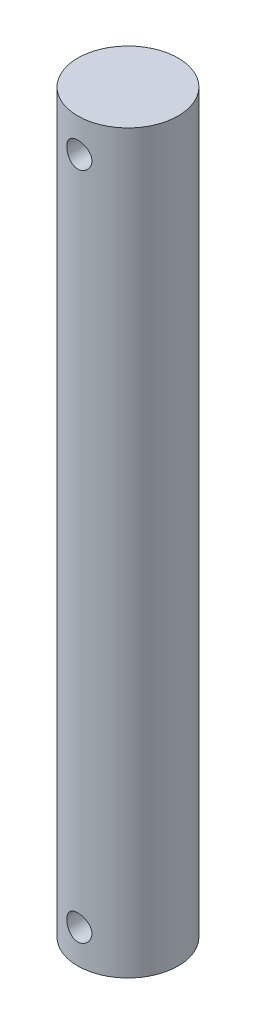
ISO-10303-21;
HEADER;
FILE_DESCRIPTION(('STEP AP214'),'2;1');
FILE_NAME('part.step','',(''),(''),'','','');
FILE_SCHEMA(('AUTOMOTIVE_DESIGN { 1 0 10303 214 1 1 1 1 }'));
ENDSEC;
DATA;
#1=APPLICATION_CONTEXT('core data for automotive mechanical design processes');
#2=APPLICATION_PROTOCOL_DEFINITION('international standard','automotive_design',2000,#1);
#3=PRODUCT_CONTEXT('',#1,'mechanical');
#4=PRODUCT('Part','Part','',(#3));
#5=PRODUCT_RELATED_PRODUCT_CATEGORY('part','',(#4));
#6=PRODUCT_DEFINITION_FORMATION('','',#4);
#7=PRODUCT_DEFINITION_CONTEXT('part definition',#1,'design');
#8=PRODUCT_DEFINITION('design','',#6,#7);
#9=PRODUCT_DEFINITION_SHAPE('','',#8);
#10=(LENGTH_UNIT() NAMED_UNIT(*) SI_UNIT(.MILLI.,.METRE.));
#11=(NAMED_UNIT(*) PLANE_ANGLE_UNIT() SI_UNIT($,.RADIAN.));
#12=(NAMED_UNIT(*) SI_UNIT($,.STERADIAN.) SOLID_ANGLE_UNIT());
#13=UNCERTAINTY_MEASURE_WITH_UNIT(LENGTH_MEASURE(1.E-05),#10,'distance_accuracy_value','');
#14=(GEOMETRIC_REPRESENTATION_CONTEXT(3) GLOBAL_UNCERTAINTY_ASSIGNED_CONTEXT((#13)) GLOBAL_UNIT_ASSIGNED_CONTEXT((#10,
#11,#12)) REPRESENTATION_CONTEXT('',''));
#15=CARTESIAN_POINT('',(0.,0.,0.));
#16=DIRECTION('',(0.,0.,1.));
#17=DIRECTION('',(1.,0.,0.));
#18=AXIS2_PLACEMENT_3D('',#15,#16,#17);
#19=CARTESIAN_POINT('',(0.,279.4,0.));
#20=DIRECTION('',(0.,-1.,0.));
#21=DIRECTION('',(0.,0.,-1.));
#22=AXIS2_PLACEMENT_3D('',#19,#20,#21);
#23=CYLINDRICAL_SURFACE('',#22,19.05);
#24=CARTESIAN_POINT('',(0.,17.4625,-19.05));
#25=CARTESIAN_POINT('',(-0.263131581526396,17.4624926157813,-19.0499955508094));
#26=CARTESIAN_POINT('',(-0.526345651112673,17.4406193262932,-19.0444938556855));
#27=CARTESIAN_POINT('',(-1.04523007797144,17.3538351446003,-19.0230796140991));
#28=CARTESIAN_POINT('',(-1.30089607381459,17.2888998597173,-19.0071611670842));
#29=CARTESIAN_POINT('',(-1.79711626917968,17.1182053702579,-18.966676136042));
#30=CARTESIAN_POINT('',(-2.03768821389026,17.012495189079,-18.9421199402354));
#31=CARTESIAN_POINT('',(-2.49768401879656,16.7634240866076,-18.886974665892));
#32=CARTESIAN_POINT('',(-2.71710716530732,16.6200618953223,-18.8563853838695));
#33=CARTESIAN_POINT('',(-3.13309611918041,16.296637492848,-18.7917903815363));
#34=CARTESIAN_POINT('',(-3.32916431594386,16.115945749505,-18.757731951953));
#35=CARTESIAN_POINT('',(-3.68855284387054,15.7243392494138,-18.6903874387445));
#36=CARTESIAN_POINT('',(-3.85186947731367,15.5134210846434,-18.6571014427033));
#37=CARTESIAN_POINT('',(-4.14345927338673,15.06348515511,-18.5945391284169));
#38=CARTESIAN_POINT('',(-4.27117578556232,14.8240964921822,-18.5653297242578));
#39=CARTESIAN_POINT('',(-4.48436018464861,14.3263987929793,-18.514996460472));
#40=CARTESIAN_POINT('',(-4.56983482602243,14.0680927891708,-18.4938713082978));
#41=CARTESIAN_POINT('',(-4.6944116068551,13.5453643932097,-18.4626401351082));
#42=CARTESIAN_POINT('',(-4.73440845195425,13.2811682050793,-18.4523218391551));
#43=CARTESIAN_POINT('',(-4.76968113583582,12.749629793427,-18.443237258092));
#44=CARTESIAN_POINT('',(-4.76496425027247,12.4822880888024,-18.4444690935868));
#45=CARTESIAN_POINT('',(-4.71165721573103,11.9589048104085,-18.458154775159));
#46=CARTESIAN_POINT('',(-4.66413323010523,11.7027464018475,-18.4703359004816));
#47=CARTESIAN_POINT('',(-4.52826179341697,11.2021586633574,-18.5041130320564));
#48=CARTESIAN_POINT('',(-4.43991143407028,10.9577301703831,-18.5257097090233));
#49=CARTESIAN_POINT('',(-4.22398659245052,10.4846817983995,-18.5761348665047));
#50=CARTESIAN_POINT('',(-4.09602516846447,10.2562464045681,-18.6050341471667));
#51=CARTESIAN_POINT('',(-3.80478117634741,9.82370809652206,-18.6667683193602));
#52=CARTESIAN_POINT('',(-3.64149242746802,9.61960944988645,-18.6996038991245));
#53=CARTESIAN_POINT('',(-3.27870637336283,9.23542852017023,-18.7666592071416));
#54=CARTESIAN_POINT('',(-3.07830936967656,9.05619699405519,-18.8008917059265));
#55=CARTESIAN_POINT('',(-2.64989283807419,8.73372255517709,-18.8660394071255));
#56=CARTESIAN_POINT('',(-2.42187246672267,8.59048074171316,-18.8969545081937));
#57=CARTESIAN_POINT('',(-1.94346794656337,8.34373938873755,-18.9521379939906));
#58=CARTESIAN_POINT('',(-1.69300967343733,8.24037804469218,-18.9763831840553));
#59=CARTESIAN_POINT('',(-1.1775313258536,8.0774625543721,-19.0153263644775));
#60=CARTESIAN_POINT('',(-0.912514047302736,8.0179000283724,-19.0300261810222));
#61=CARTESIAN_POINT('',(-0.382714405988285,7.94557222935068,-19.0479521018661));
#62=CARTESIAN_POINT('',(-0.118099585962517,7.93164839221091,-19.0514621988878));
#63=CARTESIAN_POINT('',(0.409679377494838,7.94781558152618,-19.0474220528589));
#64=CARTESIAN_POINT('',(0.672843649371642,7.97790264588726,-19.0398728054288));
#65=CARTESIAN_POINT('',(1.1862253033654,8.08028263414262,-19.0147442007933));
#66=CARTESIAN_POINT('',(1.43657675272583,8.1519435115394,-18.9973151353987));
#67=CARTESIAN_POINT('',(1.92169190353678,8.33471499179037,-18.9543914356345));
#68=CARTESIAN_POINT('',(2.15645402792872,8.44582957869448,-18.928895986747));
#69=CARTESIAN_POINT('',(2.60833595181475,8.7065997091771,-18.8719875266574));
#70=CARTESIAN_POINT('',(2.82506877782859,8.85690415685911,-18.8404775388889));
#71=CARTESIAN_POINT('',(3.23064699831755,9.19095796043101,-18.7751881667117));
#72=CARTESIAN_POINT('',(3.41948756974011,9.374713088286,-18.7414083912834));
#73=CARTESIAN_POINT('',(3.76869505363016,9.77583122567883,-18.6743643834617));
#74=CARTESIAN_POINT('',(3.92824927969698,9.99390845702379,-18.6411331577848));
#75=CARTESIAN_POINT('',(4.20849665986835,10.4544261144376,-18.5798738886387));
#76=CARTESIAN_POINT('',(4.3291915389627,10.6968654584305,-18.5518456142307));
#77=CARTESIAN_POINT('',(4.52739576042814,11.1979256686405,-18.5044745072254));
#78=CARTESIAN_POINT('',(4.60516095934267,11.456440219894,-18.4850803532866));
#79=CARTESIAN_POINT('',(4.71597247031959,11.9834331001882,-18.4571241228829));
#80=CARTESIAN_POINT('',(4.74902856223882,12.2519092369841,-18.448559677509));
#81=CARTESIAN_POINT('',(4.76897252431613,12.7829342507806,-18.4434131133217));
#82=CARTESIAN_POINT('',(4.75715932544309,13.0454318565813,-18.4464938626328));
#83=CARTESIAN_POINT('',(4.69067285863097,13.5645648465644,-18.4635111092241));
#84=CARTESIAN_POINT('',(4.63600045202908,13.8212003484504,-18.4774473883417));
#85=CARTESIAN_POINT('',(4.48605693923537,14.3199118575155,-18.5144175271476));
#86=CARTESIAN_POINT('',(4.39102945986142,14.5620654441331,-18.5373967338792));
#87=CARTESIAN_POINT('',(4.16326610069491,15.0271650901206,-18.5898712441369));
#88=CARTESIAN_POINT('',(4.03052499085823,15.2501084798697,-18.6193674513003));
#89=CARTESIAN_POINT('',(3.72703010192325,15.6767359470801,-18.6825138879017));
#90=CARTESIAN_POINT('',(3.55537504224652,15.8797659081207,-18.7162524084177));
#91=CARTESIAN_POINT('',(3.18068125352734,16.2545618672258,-18.7835548650601));
#92=CARTESIAN_POINT('',(2.97763508250412,16.4263204306088,-18.8171187578316));
#93=CARTESIAN_POINT('',(2.54148458778075,16.7367309046925,-18.8810155668159));
#94=CARTESIAN_POINT('',(2.30790249085454,16.8747268984072,-18.911278959367));
#95=CARTESIAN_POINT('',(1.82011973894576,17.1092731948362,-18.9644313679593));
#96=CARTESIAN_POINT('',(1.56593401391164,17.2058531950591,-18.9873256650929));
#97=CARTESIAN_POINT('',(1.09350255404802,17.3404905612966,-19.0197758912061));
#98=CARTESIAN_POINT('',(0.877507042633118,17.3861451966946,-19.031032075423));
#99=CARTESIAN_POINT('',(0.441026777127701,17.4471518709997,-19.0461457161143));
#100=CARTESIAN_POINT('',(0.220542361945307,17.4625061890443,-19.0500037290659));
#101=CARTESIAN_POINT('',(0.,17.4625,-19.05));
#102=B_SPLINE_CURVE_WITH_KNOTS('',3,(#24,#25,#26,#27,#28,#29,#30,#31,#32,#33,#34,#35,#36,#37,
#38,#39,#40,#41,#42,#43,#44,#45,#46,#47,#48,#49,#50,#51,#52,#53,#54,#55,#56,#57,#58,#59,#60,#61,
#62,#63,#64,#65,#66,#67,#68,#69,#70,#71,#72,#73,#74,#75,#76,#77,#78,#79,#80,#81,#82,#83,#84,#85,
#86,#87,#88,#89,#90,#91,#92,#93,#94,#95,#96,#97,#98,#99,#100,#101),.UNSPECIFIED.,.T.,.F.,(4,2,2,
2,2,2,2,2,2,2,2,2,2,2,2,2,2,2,2,2,2,2,2,2,2,2,2,2,2,2,2,2,2,2,2,2,2,2,4),(0.,0.788586537098248,
1.57762015490038,2.36570806475839,3.15382256003762,3.95650832512918,4.75928466416698,
5.57398705957939,6.38855914212746,7.18681236945898,7.98493571018357,8.76371428007826,
9.54254833515216,10.3292442601011,11.1160779341536,11.9253476558718,12.7346420935798,
13.5467162711448,14.3586350397198,15.149776309245,15.940846360435,16.7201937159261,
17.4996197925881,18.2928764053053,19.08627002561,19.8991381673475,20.7119702204023,
21.51990408414,22.3276611884506,23.1122150278763,23.8967531006066,24.6766207180149,
25.4565965385991,26.2569190512671,27.0574315904632,27.8724418898644,28.6868668015803,
29.3478662136657,30.008815904619),.UNSPECIFIED.);
#103=CARTESIAN_POINT('',(0.,17.4625,-19.05));
#104=VERTEX_POINT('',#103);
#105=EDGE_CURVE('E10',#104,#104,#102,.T.);
#106=ORIENTED_EDGE('',*,*,#105,.T.);
#107=EDGE_LOOP('',(#106));
#108=FACE_BOUND('',#107,.T.);
#109=CARTESIAN_POINT('',(4.7625,12.7,18.4450831863128));
#110=CARTESIAN_POINT('',(4.7624925297198,12.4370133194849,18.4450882066737));
#111=CARTESIAN_POINT('',(4.74064249767304,12.1739439680174,18.4507690295781));
#112=CARTESIAN_POINT('',(4.65395905400856,11.6553597635795,18.4728204709583));
#113=CARTESIAN_POINT('',(4.58910062634373,11.3998493977381,18.489197310742));
#114=CARTESIAN_POINT('',(4.41863073529905,10.9039592597534,18.5306727035566));
#115=CARTESIAN_POINT('',(4.31307188156282,10.6635604189902,18.5557599932532));
#116=CARTESIAN_POINT('',(4.06435777410296,10.2038578259115,18.6118155581478));
#117=CARTESIAN_POINT('',(3.92120092420813,9.98455496973717,18.6427840830102));
#118=CARTESIAN_POINT('',(3.59798955402915,9.56844356577547,18.7078756465746));
#119=CARTESIAN_POINT('',(3.41725927107623,9.37216769133315,18.7420490847188));
#120=CARTESIAN_POINT('',(3.02548683211178,9.01237454374355,18.8092627785663));
#121=CARTESIAN_POINT('',(2.81444184541351,8.84886033319056,18.8423029280897));
#122=CARTESIAN_POINT('',(2.36438160805543,8.55705273416241,18.9040849156671));
#123=CARTESIAN_POINT('',(2.12501716765172,8.42928263055241,18.9327603449813));
#124=CARTESIAN_POINT('',(1.62737136607773,8.21599262788838,18.98200696719));
#125=CARTESIAN_POINT('',(1.36909280243367,8.13046649510094,19.0025793557193));
#126=CARTESIAN_POINT('',(0.8465034354267,8.00579837512779,19.0329456560578));
#127=CARTESIAN_POINT('',(0.58242083074082,7.96575182755786,19.0429494777341));
#128=CARTESIAN_POINT('',(0.0511089006955942,7.93034028748007,19.0517829677441));
#129=CARTESIAN_POINT('',(-0.216119953595005,7.93496868894072,19.0506142881424));
#130=CARTESIAN_POINT('',(-0.739865077158466,7.98812508972651,19.0373907088647));
#131=CARTESIAN_POINT('',(-0.996487476800038,8.03567669922756,19.0255779445931));
#132=CARTESIAN_POINT('',(-1.49798840330767,8.17176026944243,18.992675435799));
#133=CARTESIAN_POINT('',(-1.74286630425175,8.2602944116441,18.9715851974424));
#134=CARTESIAN_POINT('',(-2.21649942542726,8.47661989715871,18.9221270597999));
#135=CARTESIAN_POINT('',(-2.44508897776269,8.60475872008009,18.8936951251828));
#136=CARTESIAN_POINT('',(-2.87786265139681,8.896392568717,18.8326376675817));
#137=CARTESIAN_POINT('',(-3.08204251709565,9.05989374560998,18.8000114154095));
#138=CARTESIAN_POINT('',(-3.46602384209109,9.42284515347436,18.733078747279));
#139=CARTESIAN_POINT('',(-3.64501594659188,9.62314856991472,18.698750756854));
#140=CARTESIAN_POINT('',(-3.96704999052758,10.051287949602,18.633091579108));
#141=CARTESIAN_POINT('',(-4.11009024968306,10.2791251989594,18.6017605318975));
#142=CARTESIAN_POINT('',(-4.35667846445951,10.7574525150312,18.5455654642112));
#143=CARTESIAN_POINT('',(-4.46003156265027,11.0080470661512,18.5207335383617));
#144=CARTESIAN_POINT('',(-4.62289026823327,11.5238253165878,18.4807600933877));
#145=CARTESIAN_POINT('',(-4.68240525869621,11.7890058808605,18.4656165006719));
#146=CARTESIAN_POINT('',(-4.75455546166981,12.3189228504355,18.4471695323144));
#147=CARTESIAN_POINT('',(-4.76838735281891,12.5834859963203,18.4435639951103));
#148=CARTESIAN_POINT('',(-4.75205486692834,13.1111407891893,18.4477788909977));
#149=CARTESIAN_POINT('',(-4.72189453990305,13.3742325693922,18.4555982722877));
#150=CARTESIAN_POINT('',(-4.61948300880314,13.8870326747285,18.48149241184));
#151=CARTESIAN_POINT('',(-4.54792855007722,14.1368895441147,18.4993972831272));
#152=CARTESIAN_POINT('',(-4.365532445582,14.6210619272102,18.5432836828994));
#153=CARTESIAN_POINT('',(-4.25468614589223,14.8553755960011,18.5692661680922));
#154=CARTESIAN_POINT('',(-3.99434812241925,15.3068806343365,18.6270164116714));
#155=CARTESIAN_POINT('',(-3.8441409410569,15.5236459402819,18.6588876619685));
#156=CARTESIAN_POINT('',(-3.51024964510029,15.9293338311368,18.7245704325042));
#157=CARTESIAN_POINT('',(-3.32656002901087,16.1182518312184,18.7583822709741));
#158=CARTESIAN_POINT('',(-2.92542620868973,16.4677300360976,18.8251605277554));
#159=CARTESIAN_POINT('',(-2.70725242393169,16.6274624191555,18.8580846242789));
#160=CARTESIAN_POINT('',(-2.24648402633337,16.9080228265421,18.9185019764907));
#161=CARTESIAN_POINT('',(-2.0038906881605,17.0288528801386,18.9459955154252));
#162=CARTESIAN_POINT('',(-1.50284593574429,17.2271296957757,18.9922807048151));
#163=CARTESIAN_POINT('',(-1.24452402714526,17.3048884617421,19.0111347619269));
#164=CARTESIAN_POINT('',(-0.71794573351829,17.415751937429,19.0382898391898));
#165=CARTESIAN_POINT('',(-0.449691276008881,17.4488652648978,19.0465928959447));
#166=CARTESIAN_POINT('',(0.0813602946863557,17.4690131453535,19.0516273180944));
#167=CARTESIAN_POINT('',(0.344108850925711,17.4572693895669,19.0486654941595));
#168=CARTESIAN_POINT('',(0.863762701675279,17.3908347225107,19.0321833187857));
#169=CARTESIAN_POINT('',(1.12066816973169,17.3361450884998,19.0186632813602));
#170=CARTESIAN_POINT('',(1.62006455725826,17.1860263033412,18.9826312396665));
#171=CARTESIAN_POINT('',(1.86262563044139,17.0908180535903,18.9601680344264));
#172=CARTESIAN_POINT('',(2.32846746511077,16.8625651174193,18.908615134513));
#173=CARTESIAN_POINT('',(2.5517457915276,16.7295156614068,18.8795246046083));
#174=CARTESIAN_POINT('',(2.978476684116,16.4256311980934,18.8169827660237));
#175=CARTESIAN_POINT('',(3.18132613177085,16.2539673194205,18.7834436818468));
#176=CARTESIAN_POINT('',(3.55575403405259,15.8793361674579,18.7161796613487));
#177=CARTESIAN_POINT('',(3.72732454817728,15.6763609695206,18.6824546800678));
#178=CARTESIAN_POINT('',(4.03746665107212,15.2403107649227,18.6179210371421));
#179=CARTESIAN_POINT('',(4.17536289997053,15.006744862473,18.5871785199404));
#180=CARTESIAN_POINT('',(4.40972684498832,14.5190107294712,18.5329808804412));
#181=CARTESIAN_POINT('',(4.50622468269464,14.264857648978,18.5095204596068));
#182=CARTESIAN_POINT('',(4.64068729231942,13.792626981135,18.4762096542539));
#183=CARTESIAN_POINT('',(4.68626747496766,13.576808804611,18.4646250755416));
#184=CARTESIAN_POINT('',(4.74717566837307,13.1406795113985,18.4490600624973));
#185=CARTESIAN_POINT('',(4.76250625969546,12.920368779586,18.4450789795187));
#186=CARTESIAN_POINT('',(4.7625,12.7,18.4450831863128));
#187=B_SPLINE_CURVE_WITH_KNOTS('',3,(#109,#110,#111,#112,#113,#114,#115,#116,#117,#118,#119,
#120,#121,#122,#123,#124,#125,#126,#127,#128,#129,#130,#131,#132,#133,#134,#135,#136,#137,#138,
#139,#140,#141,#142,#143,#144,#145,#146,#147,#148,#149,#150,#151,#152,#153,#154,#155,#156,#157,
#158,#159,#160,#161,#162,#163,#164,#165,#166,#167,#168,#169,#170,#171,#172,#173,#174,#175,#176,
#177,#178,#179,#180,#181,#182,#183,#184,#185,#186),.UNSPECIFIED.,.T.,.F.,(4,2,2,2,2,2,2,2,2,2,2,
2,2,2,2,2,2,2,2,2,2,2,2,2,2,2,2,2,2,2,2,2,2,2,2,2,2,2,4),(0.,0.78815077650734,1.57676038742161,
2.36435403525127,3.15198112469188,3.95523632737621,4.75856658419147,5.57310600638038,
6.38752519508711,7.18544570646136,7.98324823208769,8.76334790422444,9.54348910560718,
10.3306792545472,11.1180064431828,11.9266423881949,12.7353161193562,13.5479110297825,
14.3603319625162,15.1512950993064,15.9421854229939,16.7201355655679,17.4981778832205,
18.2914832137594,19.0849190099026,19.8982075550318,20.7114536696,21.5187289871145,
22.3258484568597,23.1111446488706,23.896417486174,24.677462898605,25.4586067994528,
26.258464690031,27.0585253514654,27.8735118924444,28.6879040422424,29.3483886079364,
30.0088168258541),.UNSPECIFIED.);
#188=CARTESIAN_POINT('',(4.7625,12.7,18.4450831863128));
#189=VERTEX_POINT('',#188);
#190=EDGE_CURVE('E25',#189,#189,#187,.T.);
#191=ORIENTED_EDGE('',*,*,#190,.T.);
#192=EDGE_LOOP('',(#191));
#193=FACE_BOUND('',#192,.T.);
#194=CARTESIAN_POINT('',(0.,271.4625,-19.05));
#195=CARTESIAN_POINT('',(-0.263131581526408,271.462492615781,-19.0499955508094));
#196=CARTESIAN_POINT('',(-0.526345651112703,271.440619326293,-19.0444938556855));
#197=CARTESIAN_POINT('',(-1.04523007797146,271.3538351446,-19.0230796140991));
#198=CARTESIAN_POINT('',(-1.30089607381459,271.288899859717,-19.0071611670842));
#199=CARTESIAN_POINT('',(-1.7971162691797,271.118205370258,-18.966676136042));
#200=CARTESIAN_POINT('',(-2.03768821389033,271.012495189079,-18.9421199402353));
#201=CARTESIAN_POINT('',(-2.49768401879663,270.763424086608,-18.886974665892));
#202=CARTESIAN_POINT('',(-2.71710716530733,270.620061895322,-18.8563853838695));
#203=CARTESIAN_POINT('',(-3.13309611918039,270.296637492848,-18.7917903815363));
#204=CARTESIAN_POINT('',(-3.32916431594387,270.115945749505,-18.757731951953));
#205=CARTESIAN_POINT('',(-3.68855284387057,269.724339249414,-18.6903874387445));
#206=CARTESIAN_POINT('',(-3.85186947731369,269.513421084643,-18.6571014427033));
#207=CARTESIAN_POINT('',(-4.14345927338672,269.06348515511,-18.5945391284169));
#208=CARTESIAN_POINT('',(-4.27117578556228,268.824096492182,-18.5653297242578));
#209=CARTESIAN_POINT('',(-4.48436018464857,268.32639879298,-18.514996460472));
#210=CARTESIAN_POINT('',(-4.56983482602244,268.068092789171,-18.4938713082978));
#211=CARTESIAN_POINT('',(-4.69441160685515,267.54536439321,-18.4626401351082));
#212=CARTESIAN_POINT('',(-4.73440845195426,267.28116820508,-18.4523218391551));
#213=CARTESIAN_POINT('',(-4.76968113583584,266.749629793427,-18.443237258092));
#214=CARTESIAN_POINT('',(-4.76496425027251,266.482288088802,-18.4444690935868));
#215=CARTESIAN_POINT('',(-4.71165721573105,265.958904810408,-18.458154775159));
#216=CARTESIAN_POINT('',(-4.66413323010522,265.702746401847,-18.4703359004816));
#217=CARTESIAN_POINT('',(-4.52826179341697,265.202158663357,-18.5041130320564));
#218=CARTESIAN_POINT('',(-4.43991143407032,264.957730170383,-18.5257097090233));
#219=CARTESIAN_POINT('',(-4.22398659245056,264.484681798399,-18.5761348665047));
#220=CARTESIAN_POINT('',(-4.09602516846447,264.256246404568,-18.6050341471667));
#221=CARTESIAN_POINT('',(-3.8047811763474,263.823708096522,-18.6667683193602));
#222=CARTESIAN_POINT('',(-3.64149242746803,263.619609449886,-18.6996038991245));
#223=CARTESIAN_POINT('',(-3.27870637336289,263.23542852017,-18.7666592071416));
#224=CARTESIAN_POINT('',(-3.07830936967664,263.056196994055,-18.8008917059265));
#225=CARTESIAN_POINT('',(-2.64989283807425,262.733722555177,-18.8660394071255));
#226=CARTESIAN_POINT('',(-2.42187246672267,262.590480741713,-18.8969545081937));
#227=CARTESIAN_POINT('',(-1.94346794656334,262.343739388738,-18.9521379939906));
#228=CARTESIAN_POINT('',(-1.69300967343732,262.240378044692,-18.9763831840553));
#229=CARTESIAN_POINT('',(-1.17753132585363,262.077462554372,-19.0153263644775));
#230=CARTESIAN_POINT('',(-0.912514047302797,262.017900028372,-19.0300261810222));
#231=CARTESIAN_POINT('',(-0.382714405988362,261.94557222935,-19.0479521018661));
#232=CARTESIAN_POINT('',(-0.118099585962586,261.931648392211,-19.0514621988878));
#233=CARTESIAN_POINT('',(0.409679377494778,261.947815581526,-19.0474220528589));
#234=CARTESIAN_POINT('',(0.672843649371583,261.977902645887,-19.0398728054288));
#235=CARTESIAN_POINT('',(1.18622530336537,262.080282634143,-19.0147442007933));
#236=CARTESIAN_POINT('',(1.43657675272581,262.151943511539,-18.9973151353987));
#237=CARTESIAN_POINT('',(1.92169190353677,262.33471499179,-18.9543914356345));
#238=CARTESIAN_POINT('',(2.1564540279287,262.445829578694,-18.928895986747));
#239=CARTESIAN_POINT('',(2.6083359518147,262.706599709177,-18.8719875266574));
#240=CARTESIAN_POINT('',(2.82506877782851,262.856904156859,-18.8404775388889));
#241=CARTESIAN_POINT('',(3.23064699831748,263.190957960431,-18.7751881667117));
#242=CARTESIAN_POINT('',(3.41948756974009,263.374713088286,-18.7414083912833));
#243=CARTESIAN_POINT('',(3.76869505363016,263.775831225679,-18.6743643834617));
#244=CARTESIAN_POINT('',(3.92824927969695,263.993908457024,-18.6411331577848));
#245=CARTESIAN_POINT('',(4.2084966598683,264.454426114438,-18.5798738886387));
#246=CARTESIAN_POINT('',(4.32919153896265,264.696865458431,-18.5518456142307));
#247=CARTESIAN_POINT('',(4.52739576042812,265.197925668641,-18.5044745072254));
#248=CARTESIAN_POINT('',(4.60516095934268,265.456440219894,-18.4850803532866));
#249=CARTESIAN_POINT('',(4.71597247031959,265.983433100188,-18.4571241228829));
#250=CARTESIAN_POINT('',(4.7490285622388,266.251909236984,-18.448559677509));
#251=CARTESIAN_POINT('',(4.76897252431608,266.782934250781,-18.4434131133217));
#252=CARTESIAN_POINT('',(4.75715932544303,267.045431856581,-18.4464938626329));
#253=CARTESIAN_POINT('',(4.69067285863092,267.564564846565,-18.4635111092241));
#254=CARTESIAN_POINT('',(4.63600045202906,267.821200348451,-18.4774473883417));
#255=CARTESIAN_POINT('',(4.48605693923531,268.319911857516,-18.5144175271476));
#256=CARTESIAN_POINT('',(4.3910294598613,268.562065444133,-18.5373967338792));
#257=CARTESIAN_POINT('',(4.1632661006948,269.027165090121,-18.5898712441369));
#258=CARTESIAN_POINT('',(4.0305249908582,269.25010847987,-18.6193674513003));
#259=CARTESIAN_POINT('',(3.72703010192328,269.67673594708,-18.6825138879017));
#260=CARTESIAN_POINT('',(3.55537504224653,269.879765908121,-18.7162524084177));
#261=CARTESIAN_POINT('',(3.18068125352732,270.254561867226,-18.7835548650601));
#262=CARTESIAN_POINT('',(2.97763508250409,270.426320430609,-18.8171187578316));
#263=CARTESIAN_POINT('',(2.54148458778073,270.736730904692,-18.8810155668159));
#264=CARTESIAN_POINT('',(2.30790249085456,270.874726898407,-18.911278959367));
#265=CARTESIAN_POINT('',(1.82011973894579,271.109273194836,-18.9644313679593));
#266=CARTESIAN_POINT('',(1.56593401391165,271.205853195059,-18.9873256650929));
#267=CARTESIAN_POINT('',(1.093502554048,271.340490561297,-19.0197758912061));
#268=CARTESIAN_POINT('',(0.877507042633106,271.386145196695,-19.031032075423));
#269=CARTESIAN_POINT('',(0.441026777127698,271.447151871,-19.0461457161143));
#270=CARTESIAN_POINT('',(0.220542361945308,271.462506189044,-19.0500037290659));
#271=CARTESIAN_POINT('',(0.,271.4625,-19.05));
#272=B_SPLINE_CURVE_WITH_KNOTS('',3,(#194,#195,#196,#197,#198,#199,#200,#201,#202,#203,#204,
#205,#206,#207,#208,#209,#210,#211,#212,#213,#214,#215,#216,#217,#218,#219,#220,#221,#222,#223,
#224,#225,#226,#227,#228,#229,#230,#231,#232,#233,#234,#235,#236,#237,#238,#239,#240,#241,#242,
#243,#244,#245,#246,#247,#248,#249,#250,#251,#252,#253,#254,#255,#256,#257,#258,#259,#260,#261,
#262,#263,#264,#265,#266,#267,#268,#269,#270,#271),.UNSPECIFIED.,.T.,.F.,(4,2,2,2,2,2,2,2,2,2,2,
2,2,2,2,2,2,2,2,2,2,2,2,2,2,2,2,2,2,2,2,2,2,2,2,2,2,2,4),(0.,0.788586537098271,1.57762015490044,
2.36570806475845,3.15382256003764,3.95650832512917,4.75928466416691,5.57398705957923,
6.38855914212707,7.18681236945882,7.98493571018363,8.76371428007837,9.54254833515231,
10.3292442601012,11.1160779341536,11.9253476558717,12.7346420935797,13.5467162711448,
14.3586350397198,15.1497763092449,15.940846360435,16.7201937159261,17.4996197925881,
18.2928764053053,19.0862700256099,19.8991381673475,20.7119702204024,21.5199040841401,
22.3276611884508,23.1122150278765,23.8967531006068,24.6766207180152,25.4565965385992,
26.2569190512671,27.0574315904631,27.8724418898643,28.6868668015803,29.3478662136657,
30.008815904619),.UNSPECIFIED.);
#273=CARTESIAN_POINT('',(0.,271.4625,-19.05));
#274=VERTEX_POINT('',#273);
#275=EDGE_CURVE('E29',#274,#274,#272,.T.);
#276=ORIENTED_EDGE('',*,*,#275,.T.);
#277=EDGE_LOOP('',(#276));
#278=FACE_BOUND('',#277,.T.);
#279=CARTESIAN_POINT('',(4.7625,266.7,18.4450831863128));
#280=CARTESIAN_POINT('',(4.7624925297198,266.437013319485,18.4450882066738));
#281=CARTESIAN_POINT('',(4.74064249767303,266.173943968017,18.4507690295781));
#282=CARTESIAN_POINT('',(4.65395905400853,265.655359763579,18.4728204709583));
#283=CARTESIAN_POINT('',(4.58910062634371,265.399849397738,18.4891973107421));
#284=CARTESIAN_POINT('',(4.41863073529902,264.903959259753,18.5306727035567));
#285=CARTESIAN_POINT('',(4.31307188156279,264.66356041899,18.5557599932532));
#286=CARTESIAN_POINT('',(4.06435777410293,264.203857825911,18.6118155581478));
#287=CARTESIAN_POINT('',(3.92120092420812,263.984554969737,18.6427840830102));
#288=CARTESIAN_POINT('',(3.59798955402914,263.568443565775,18.7078756465746));
#289=CARTESIAN_POINT('',(3.41725927107619,263.372167691333,18.7420490847188));
#290=CARTESIAN_POINT('',(3.02548683211172,263.012374543744,18.8092627785664));
#291=CARTESIAN_POINT('',(2.81444184541344,262.848860333191,18.8423029280897));
#292=CARTESIAN_POINT('',(2.36438160805538,262.557052734162,18.9040849156671));
#293=CARTESIAN_POINT('',(2.12501716765169,262.429282630552,18.9327603449813));
#294=CARTESIAN_POINT('',(1.62737136607769,262.215992627888,18.98200696719));
#295=CARTESIAN_POINT('',(1.3690928024336,262.130466495101,19.0025793557193));
#296=CARTESIAN_POINT('',(0.846503435426635,262.005798375128,19.0329456560578));
#297=CARTESIAN_POINT('',(0.582420830740769,261.965751827558,19.0429494777341));
#298=CARTESIAN_POINT('',(0.0511089006955612,261.93034028748,19.0517829677441));
#299=CARTESIAN_POINT('',(-0.216119953595033,261.934968688941,19.0506142881424));
#300=CARTESIAN_POINT('',(-0.739865077158524,261.988125089727,19.0373907088647));
#301=CARTESIAN_POINT('',(-0.996487476800129,262.035676699228,19.0255779445931));
#302=CARTESIAN_POINT('',(-1.49798840330776,262.171760269442,18.992675435799));
#303=CARTESIAN_POINT('',(-1.7428663042518,262.260294411644,18.9715851974424));
#304=CARTESIAN_POINT('',(-2.21649942542728,262.476619897159,18.9221270597999));
#305=CARTESIAN_POINT('',(-2.44508897776274,262.60475872008,18.8936951251829));
#306=CARTESIAN_POINT('',(-2.87786265139686,262.896392568717,18.8326376675817));
#307=CARTESIAN_POINT('',(-3.0820425170957,263.05989374561,18.8000114154095));
#308=CARTESIAN_POINT('',(-3.46602384209113,263.422845153474,18.733078747279));
#309=CARTESIAN_POINT('',(-3.64501594659193,263.623148569915,18.6987507568539));
#310=CARTESIAN_POINT('',(-3.96704999052763,264.051287949602,18.6330915791081));
#311=CARTESIAN_POINT('',(-4.11009024968311,264.279125198959,18.6017605318975));
#312=CARTESIAN_POINT('',(-4.35667846445954,264.757452515031,18.5455654642112));
#313=CARTESIAN_POINT('',(-4.4600315626503,265.008047066151,18.5207335383617));
#314=CARTESIAN_POINT('',(-4.6228902682333,265.523825316588,18.4807600933877));
#315=CARTESIAN_POINT('',(-4.68240525869625,265.78900588086,18.4656165006719));
#316=CARTESIAN_POINT('',(-4.75455546166984,266.318922850436,18.4471695323144));
#317=CARTESIAN_POINT('',(-4.76838735281894,266.58348599632,18.4435639951103));
#318=CARTESIAN_POINT('',(-4.75205486692836,267.111140789189,18.4477788909977));
#319=CARTESIAN_POINT('',(-4.72189453990307,267.374232569392,18.4555982722877));
#320=CARTESIAN_POINT('',(-4.61948300880315,267.887032674729,18.48149241184));
#321=CARTESIAN_POINT('',(-4.54792855007724,268.136889544115,18.4993972831272));
#322=CARTESIAN_POINT('',(-4.36553244558201,268.62106192721,18.5432836828994));
#323=CARTESIAN_POINT('',(-4.25468614589223,268.855375596001,18.5692661680922));
#324=CARTESIAN_POINT('',(-3.99434812241926,269.306880634336,18.6270164116714));
#325=CARTESIAN_POINT('',(-3.84414094105691,269.523645940282,18.6588876619685));
#326=CARTESIAN_POINT('',(-3.51024964510032,269.929333831137,18.7245704325042));
#327=CARTESIAN_POINT('',(-3.3265600290109,270.118251831218,18.7583822709741));
#328=CARTESIAN_POINT('',(-2.92542620868973,270.467730036098,18.8251605277554));
#329=CARTESIAN_POINT('',(-2.70725242393165,270.627462419155,18.8580846242789));
#330=CARTESIAN_POINT('',(-2.24648402633333,270.908022826542,18.9185019764908));
#331=CARTESIAN_POINT('',(-2.0038906881605,271.028852880139,18.9459955154252));
#332=CARTESIAN_POINT('',(-1.5028459357443,271.227129695776,18.9922807048151));
#333=CARTESIAN_POINT('',(-1.24452402714524,271.304888461742,19.0111347619269));
#334=CARTESIAN_POINT('',(-0.717945733518264,271.415751937429,19.0382898391898));
#335=CARTESIAN_POINT('',(-0.44969127600888,271.448865264898,19.0465928959447));
#336=CARTESIAN_POINT('',(0.0813602946863381,271.469013145354,19.0516273180944));
#337=CARTESIAN_POINT('',(0.344108850925701,271.457269389567,19.0486654941595));
#338=CARTESIAN_POINT('',(0.863762701675272,271.390834722511,19.0321833187857));
#339=CARTESIAN_POINT('',(1.12066816973168,271.3361450885,19.0186632813602));
#340=CARTESIAN_POINT('',(1.62006455725828,271.186026303341,18.9826312396665));
#341=CARTESIAN_POINT('',(1.86262563044144,271.09081805359,18.9601680344264));
#342=CARTESIAN_POINT('',(2.3284674651108,270.862565117419,18.908615134513));
#343=CARTESIAN_POINT('',(2.5517457915276,270.729515661407,18.8795246046083));
#344=CARTESIAN_POINT('',(2.97847668411599,270.425631198093,18.8169827660237));
#345=CARTESIAN_POINT('',(3.18132613177087,270.25396731942,18.7834436818468));
#346=CARTESIAN_POINT('',(3.55575403405261,269.879336167458,18.7161796613487));
#347=CARTESIAN_POINT('',(3.72732454817727,269.676360969521,18.6824546800678));
#348=CARTESIAN_POINT('',(4.0374666510721,269.240310764923,18.6179210371421));
#349=CARTESIAN_POINT('',(4.17536289997052,269.006744862473,18.5871785199404));
#350=CARTESIAN_POINT('',(4.40972684498832,268.519010729471,18.5329808804412));
#351=CARTESIAN_POINT('',(4.50622468269464,268.264857648978,18.5095204596068));
#352=CARTESIAN_POINT('',(4.64068729231941,267.792626981135,18.4762096542539));
#353=CARTESIAN_POINT('',(4.68626747496764,267.576808804611,18.4646250755416));
#354=CARTESIAN_POINT('',(4.74717566837305,267.140679511398,18.4490600624973));
#355=CARTESIAN_POINT('',(4.76250625969546,266.920368779586,18.4450789795188));
#356=CARTESIAN_POINT('',(4.7625,266.7,18.4450831863128));
#357=B_SPLINE_CURVE_WITH_KNOTS('',3,(#279,#280,#281,#282,#283,#284,#285,#286,#287,#288,#289,
#290,#291,#292,#293,#294,#295,#296,#297,#298,#299,#300,#301,#302,#303,#304,#305,#306,#307,#308,
#309,#310,#311,#312,#313,#314,#315,#316,#317,#318,#319,#320,#321,#322,#323,#324,#325,#326,#327,
#328,#329,#330,#331,#332,#333,#334,#335,#336,#337,#338,#339,#340,#341,#342,#343,#344,#345,#346,
#347,#348,#349,#350,#351,#352,#353,#354,#355,#356),.UNSPECIFIED.,.T.,.F.,(4,2,2,2,2,2,2,2,2,2,2,
2,2,2,2,2,2,2,2,2,2,2,2,2,2,2,2,2,2,2,2,2,2,2,2,2,2,2,4),(0.,0.788150776507276,1.57676038742158,
2.36435403525126,3.15198112469193,3.95523632737624,4.75856658419147,5.57310600638041,
6.38752519508712,7.18544570646135,7.9832482320877,8.76334790422444,9.54348910560717,
10.3306792545471,11.1180064431827,11.9266423881949,12.7353161193563,13.5479110297824,
14.360331962516,15.1512950993064,15.942185422994,16.7201355655678,17.4981778832203,
18.2914832137594,19.0849190099026,19.8982075550318,20.7114536696,21.5187289871145,
22.3258484568596,23.1111446488705,23.896417486174,24.677462898605,25.4586067994528,
26.258464690031,27.0585253514654,27.8735118924444,28.6879040422423,29.3483886079363,
30.008816825854),.UNSPECIFIED.);
#358=CARTESIAN_POINT('',(4.7625,266.7,18.4450831863128));
#359=VERTEX_POINT('',#358);
#360=EDGE_CURVE('E33',#359,#359,#357,.T.);
#361=ORIENTED_EDGE('',*,*,#360,.T.);
#362=EDGE_LOOP('',(#361));
#363=FACE_BOUND('',#362,.T.);
#364=CARTESIAN_POINT('',(0.,279.4,0.));
#365=DIRECTION('',(0.,1.,0.));
#366=DIRECTION('',(0.,0.,1.));
#367=AXIS2_PLACEMENT_3D('',#364,#365,#366);
#368=CIRCLE('',#367,19.05);
#369=CARTESIAN_POINT('',(0.,279.4,19.05));
#370=VERTEX_POINT('',#369);
#371=EDGE_CURVE('E58',#370,#370,#368,.T.);
#372=ORIENTED_EDGE('',*,*,#371,.F.);
#373=EDGE_LOOP('',(#372));
#374=FACE_BOUND('',#373,.T.);
#375=CARTESIAN_POINT('',(0.,0.,0.));
#376=DIRECTION('',(0.,1.,0.));
#377=DIRECTION('',(0.,0.,1.));
#378=AXIS2_PLACEMENT_3D('',#375,#376,#377);
#379=CIRCLE('',#378,19.05);
#380=CARTESIAN_POINT('',(0.,0.,19.05));
#381=VERTEX_POINT('',#380);
#382=EDGE_CURVE('E59',#381,#381,#379,.T.);
#383=ORIENTED_EDGE('',*,*,#382,.T.);
#384=EDGE_LOOP('',(#383));
#385=FACE_BOUND('',#384,.T.);
#386=ADVANCED_FACE('F15',(#108,#193,#278,#363,#374,#385),#23,.T.);
#387=CARTESIAN_POINT('',(0.,279.4,0.));
#388=DIRECTION('',(0.,1.,0.));
#389=DIRECTION('',(0.,0.,1.));
#390=AXIS2_PLACEMENT_3D('',#387,#388,#389);
#391=PLANE('',#390);
#392=ORIENTED_EDGE('',*,*,#371,.T.);
#393=EDGE_LOOP('',(#392));
#394=FACE_BOUND('',#393,.T.);
#395=ADVANCED_FACE('F52',(#394),#391,.T.);
#396=CARTESIAN_POINT('',(0.,0.,0.));
#397=DIRECTION('',(0.,1.,0.));
#398=DIRECTION('',(0.,0.,1.));
#399=AXIS2_PLACEMENT_3D('',#396,#397,#398);
#400=PLANE('',#399);
#401=ORIENTED_EDGE('',*,*,#382,.F.);
#402=EDGE_LOOP('',(#401));
#403=FACE_BOUND('',#402,.T.);
#404=ADVANCED_FACE('F50',(#403),#400,.F.);
#405=CARTESIAN_POINT('',(0.,266.7,-19.05));
#406=DIRECTION('',(0.,0.,1.));
#407=DIRECTION('',(1.,0.,0.));
#408=AXIS2_PLACEMENT_3D('',#405,#406,#407);
#409=CYLINDRICAL_SURFACE('',#408,4.7625);
#410=ORIENTED_EDGE('',*,*,#360,.F.);
#411=EDGE_LOOP('',(#410));
#412=FACE_BOUND('',#411,.T.);
#413=ORIENTED_EDGE('',*,*,#275,.F.);
#414=EDGE_LOOP('',(#413));
#415=FACE_BOUND('',#414,.T.);
#416=ADVANCED_FACE('F44',(#412,#415),#409,.F.);
#417=CARTESIAN_POINT('',(0.,12.7,-19.05));
#418=DIRECTION('',(0.,0.,1.));
#419=DIRECTION('',(1.,0.,0.));
#420=AXIS2_PLACEMENT_3D('',#417,#418,#419);
#421=CYLINDRICAL_SURFACE('',#420,4.7625);
#422=ORIENTED_EDGE('',*,*,#190,.F.);
#423=EDGE_LOOP('',(#422));
#424=FACE_BOUND('',#423,.T.);
#425=ORIENTED_EDGE('',*,*,#105,.F.);
#426=EDGE_LOOP('',(#425));
#427=FACE_BOUND('',#426,.T.);
#428=ADVANCED_FACE('F41',(#424,#427),#421,.F.);
#429=CLOSED_SHELL('',(#386,#395,#404,#416,#428));
#430=MANIFOLD_SOLID_BREP('B1',#429);
#431=ADVANCED_BREP_SHAPE_REPRESENTATION('',(#18,#430),#14);
#432=SHAPE_DEFINITION_REPRESENTATION(#9,#431);
ENDSEC;
END-ISO-10303-21;
